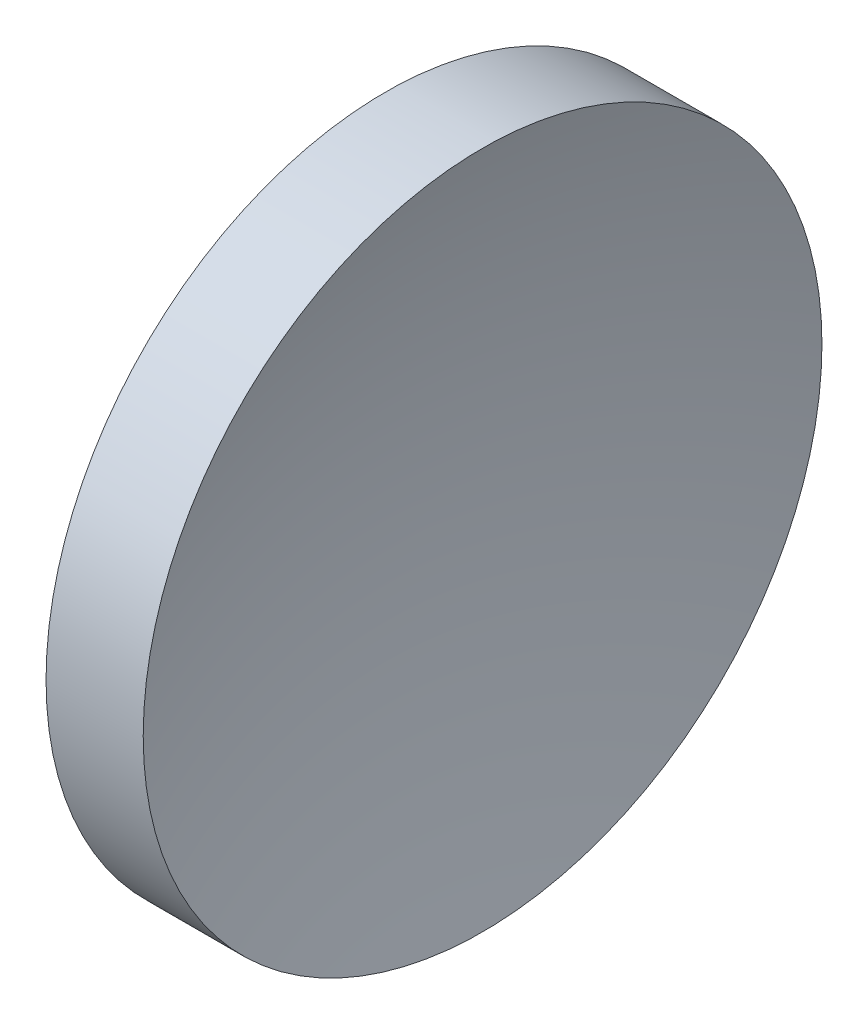
ISO-10303-21;
HEADER;
FILE_DESCRIPTION(('STEP AP214'),'2;1');
FILE_NAME('part.step','',(''),(''),'','','');
FILE_SCHEMA(('AUTOMOTIVE_DESIGN { 1 0 10303 214 1 1 1 1 }'));
ENDSEC;
DATA;
#1=APPLICATION_CONTEXT('core data for automotive mechanical design processes');
#2=APPLICATION_PROTOCOL_DEFINITION('international standard','automotive_design',2000,#1);
#3=PRODUCT_CONTEXT('',#1,'mechanical');
#4=PRODUCT('Part','Part','',(#3));
#5=PRODUCT_RELATED_PRODUCT_CATEGORY('part','',(#4));
#6=PRODUCT_DEFINITION_FORMATION('','',#4);
#7=PRODUCT_DEFINITION_CONTEXT('part definition',#1,'design');
#8=PRODUCT_DEFINITION('design','',#6,#7);
#9=PRODUCT_DEFINITION_SHAPE('','',#8);
#10=(LENGTH_UNIT() NAMED_UNIT(*) SI_UNIT(.MILLI.,.METRE.));
#11=(NAMED_UNIT(*) PLANE_ANGLE_UNIT() SI_UNIT($,.RADIAN.));
#12=(NAMED_UNIT(*) SI_UNIT($,.STERADIAN.) SOLID_ANGLE_UNIT());
#13=UNCERTAINTY_MEASURE_WITH_UNIT(LENGTH_MEASURE(1.E-05),#10,'distance_accuracy_value','');
#14=(GEOMETRIC_REPRESENTATION_CONTEXT(3) GLOBAL_UNCERTAINTY_ASSIGNED_CONTEXT((#13)) GLOBAL_UNIT_ASSIGNED_CONTEXT((#10,
#11,#12)) REPRESENTATION_CONTEXT('',''));
#15=CARTESIAN_POINT('',(0.,0.,0.));
#16=DIRECTION('',(0.,0.,1.));
#17=DIRECTION('',(1.,0.,0.));
#18=AXIS2_PLACEMENT_3D('',#15,#16,#17);
#19=CARTESIAN_POINT('',(180.961751457322,65.1556304570152,-0.152531836743922));
#20=DIRECTION('',(0.,-1.,0.));
#21=DIRECTION('',(0.,0.,1.));
#22=AXIS2_PLACEMENT_3D('',#19,#20,#21);
#23=CIRCLE('',#22,64.55);
#24=TRIMMED_CURVE('',#23,(PARAMETER_VALUE(-1.5684333217028)),(PARAMETER_VALUE(1.5684333217028)),
.T.,.PARAMETER.);
#25=CARTESIAN_POINT('',(180.961751457322,65.1556304570152,0.));
#26=DIRECTION('',(-1.,0.,0.));
#27=AXIS1_PLACEMENT('',#25,#26);
#28=SURFACE_OF_REVOLUTION('',#24,#27);
#29=CARTESIAN_POINT('',(119.638200022584,65.1556304570152,0.));
#30=DIRECTION('',(-1.,0.,0.));
#31=DIRECTION('',(0.,0.,1.));
#32=AXIS2_PLACEMENT_3D('',#29,#30,#31);
#33=CIRCLE('',#32,20.);
#34=CARTESIAN_POINT('',(119.638200022584,65.1556304570152,20.));
#35=VERTEX_POINT('',#34);
#36=EDGE_CURVE('E11',#35,#35,#33,.T.);
#37=ORIENTED_EDGE('',*,*,#36,.F.);
#38=EDGE_LOOP('',(#37));
#39=FACE_BOUND('',#38,.T.);
#40=CARTESIAN_POINT('',(116.41193167416,65.1556304570152,0.));
#41=VERTEX_POINT('',#40);
#42=VERTEX_LOOP('',#41);
#43=FACE_BOUND('',#42,.T.);
#44=ADVANCED_FACE('F37',(#39,#43),#28,.F.);
#45=CARTESIAN_POINT('',(105.62183712383,65.1556304570152,0.));
#46=DIRECTION('',(-1.,0.,0.));
#47=DIRECTION('',(0.,0.,1.));
#48=AXIS2_PLACEMENT_3D('',#45,#46,#47);
#49=CYLINDRICAL_SURFACE('',#48,20.);
#50=CARTESIAN_POINT('',(113.91193167416,65.1556304570152,0.));
#51=DIRECTION('',(-1.,0.,0.));
#52=DIRECTION('',(0.,0.,1.));
#53=AXIS2_PLACEMENT_3D('',#50,#51,#52);
#54=CIRCLE('',#53,20.);
#55=CARTESIAN_POINT('',(113.91193167416,65.1556304570152,20.));
#56=VERTEX_POINT('',#55);
#57=EDGE_CURVE('E43',#56,#56,#54,.T.);
#58=ORIENTED_EDGE('',*,*,#57,.F.);
#59=EDGE_LOOP('',(#58));
#60=FACE_BOUND('',#59,.T.);
#61=ORIENTED_EDGE('',*,*,#36,.T.);
#62=EDGE_LOOP('',(#61));
#63=FACE_BOUND('',#62,.T.);
#64=ADVANCED_FACE('F47',(#60,#63),#49,.T.);
#65=CARTESIAN_POINT('',(113.91193167416,65.1556304570152,0.));
#66=DIRECTION('',(1.,0.,0.));
#67=DIRECTION('',(0.,0.,-1.));
#68=AXIS2_PLACEMENT_3D('',#65,#66,#67);
#69=PLANE('',#68);
#70=ORIENTED_EDGE('',*,*,#57,.T.);
#71=EDGE_LOOP('',(#70));
#72=FACE_BOUND('',#71,.T.);
#73=ADVANCED_FACE('F52',(#72),#69,.F.);
#74=CLOSED_SHELL('',(#44,#64,#73));
#75=MANIFOLD_SOLID_BREP('B2',#74);
#76=ADVANCED_BREP_SHAPE_REPRESENTATION('',(#18,#75),#14);
#77=SHAPE_DEFINITION_REPRESENTATION(#9,#76);
ENDSEC;
END-ISO-10303-21;
